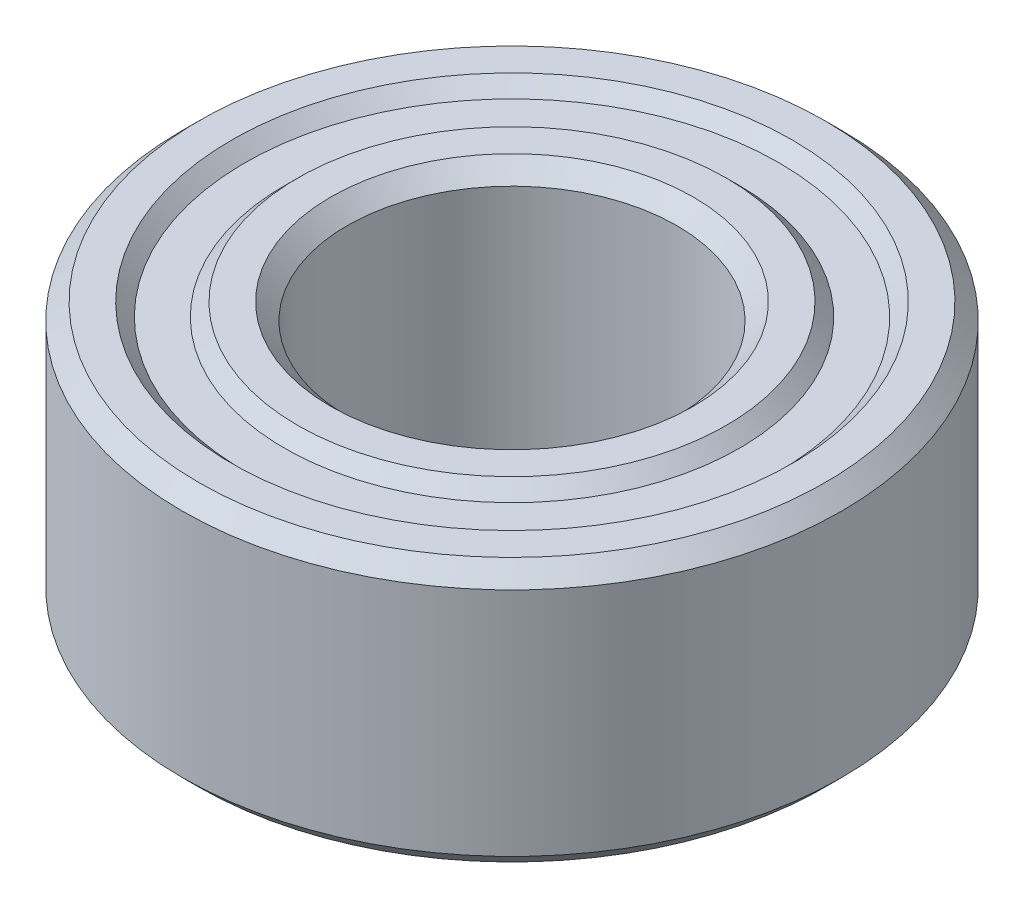
ISO-10303-21;
HEADER;
FILE_DESCRIPTION(('STEP AP214'),'2;1');
FILE_NAME('part.step','',(''),(''),'','','');
FILE_SCHEMA(('AUTOMOTIVE_DESIGN { 1 0 10303 214 1 1 1 1 }'));
ENDSEC;
DATA;
#1=APPLICATION_CONTEXT('core data for automotive mechanical design processes');
#2=APPLICATION_PROTOCOL_DEFINITION('international standard','automotive_design',2000,#1);
#3=PRODUCT_CONTEXT('',#1,'mechanical');
#4=PRODUCT('Part','Part','',(#3));
#5=PRODUCT_RELATED_PRODUCT_CATEGORY('part','',(#4));
#6=PRODUCT_DEFINITION_FORMATION('','',#4);
#7=PRODUCT_DEFINITION_CONTEXT('part definition',#1,'design');
#8=PRODUCT_DEFINITION('design','',#6,#7);
#9=PRODUCT_DEFINITION_SHAPE('','',#8);
#10=(LENGTH_UNIT() NAMED_UNIT(*) SI_UNIT(.MILLI.,.METRE.));
#11=(NAMED_UNIT(*) PLANE_ANGLE_UNIT() SI_UNIT($,.RADIAN.));
#12=(NAMED_UNIT(*) SI_UNIT($,.STERADIAN.) SOLID_ANGLE_UNIT());
#13=UNCERTAINTY_MEASURE_WITH_UNIT(LENGTH_MEASURE(1.E-05),#10,'distance_accuracy_value','');
#14=(GEOMETRIC_REPRESENTATION_CONTEXT(3) GLOBAL_UNCERTAINTY_ASSIGNED_CONTEXT((#13)) GLOBAL_UNIT_ASSIGNED_CONTEXT((#10,
#11,#12)) REPRESENTATION_CONTEXT('',''));
#15=CARTESIAN_POINT('',(0.,0.,0.));
#16=DIRECTION('',(0.,0.,1.));
#17=DIRECTION('',(1.,0.,0.));
#18=AXIS2_PLACEMENT_3D('',#15,#16,#17);
#19=CARTESIAN_POINT('',(0.,2.,0.));
#20=DIRECTION('',(0.,1.,0.));
#21=DIRECTION('',(0.,0.,1.));
#22=AXIS2_PLACEMENT_3D('',#19,#20,#21);
#23=CONICAL_SURFACE('',#22,2.75,0.785398163397447);
#24=CARTESIAN_POINT('',(0.,1.75,0.));
#25=DIRECTION('',(0.,-1.,0.));
#26=DIRECTION('',(0.,0.,-1.));
#27=AXIS2_PLACEMENT_3D('',#24,#25,#26);
#28=CIRCLE('',#27,2.5);
#29=CARTESIAN_POINT('',(0.,1.75,-2.5));
#30=VERTEX_POINT('',#29);
#31=EDGE_CURVE('E10',#30,#30,#28,.T.);
#32=ORIENTED_EDGE('',*,*,#31,.T.);
#33=EDGE_LOOP('',(#32));
#34=FACE_BOUND('',#33,.T.);
#35=CARTESIAN_POINT('',(0.,2.,0.));
#36=DIRECTION('',(0.,-1.,0.));
#37=DIRECTION('',(0.,0.,-1.));
#38=AXIS2_PLACEMENT_3D('',#35,#36,#37);
#39=CIRCLE('',#38,2.75);
#40=CARTESIAN_POINT('',(0.,2.,-2.75));
#41=VERTEX_POINT('',#40);
#42=EDGE_CURVE('E88',#41,#41,#39,.T.);
#43=ORIENTED_EDGE('',*,*,#42,.F.);
#44=EDGE_LOOP('',(#43));
#45=FACE_BOUND('',#44,.T.);
#46=ADVANCED_FACE('F36',(#34,#45),#23,.F.);
#47=CARTESIAN_POINT('',(0.,-1.34942197217015,0.));
#48=DIRECTION('',(0.,-1.,0.));
#49=DIRECTION('',(0.,0.,-1.));
#50=AXIS2_PLACEMENT_3D('',#47,#48,#49);
#51=CYLINDRICAL_SURFACE('',#50,2.5);
#52=CARTESIAN_POINT('',(0.,-1.75,0.));
#53=DIRECTION('',(0.,-1.,0.));
#54=DIRECTION('',(0.,0.,-1.));
#55=AXIS2_PLACEMENT_3D('',#52,#53,#54);
#56=CIRCLE('',#55,2.5);
#57=CARTESIAN_POINT('',(0.,-1.75,-2.5));
#58=VERTEX_POINT('',#57);
#59=EDGE_CURVE('E42',#58,#58,#56,.T.);
#60=ORIENTED_EDGE('',*,*,#59,.T.);
#61=EDGE_LOOP('',(#60));
#62=FACE_BOUND('',#61,.T.);
#63=ORIENTED_EDGE('',*,*,#31,.F.);
#64=EDGE_LOOP('',(#63));
#65=FACE_BOUND('',#64,.T.);
#66=ADVANCED_FACE('F96',(#62,#65),#51,.F.);
#67=CARTESIAN_POINT('',(0.,-1.75,0.));
#68=DIRECTION('',(0.,-1.,0.));
#69=DIRECTION('',(0.,0.,-1.));
#70=AXIS2_PLACEMENT_3D('',#67,#68,#69);
#71=CONICAL_SURFACE('',#70,2.5,0.785398163397447);
#72=CARTESIAN_POINT('',(0.,-2.,0.));
#73=DIRECTION('',(0.,-1.,0.));
#74=DIRECTION('',(0.,0.,-1.));
#75=AXIS2_PLACEMENT_3D('',#72,#73,#74);
#76=CIRCLE('',#75,2.75);
#77=CARTESIAN_POINT('',(0.,-2.,-2.75));
#78=VERTEX_POINT('',#77);
#79=EDGE_CURVE('E46',#78,#78,#76,.T.);
#80=ORIENTED_EDGE('',*,*,#79,.T.);
#81=EDGE_LOOP('',(#80));
#82=FACE_BOUND('',#81,.T.);
#83=ORIENTED_EDGE('',*,*,#59,.F.);
#84=EDGE_LOOP('',(#83));
#85=FACE_BOUND('',#84,.T.);
#86=ADVANCED_FACE('F100',(#82,#85),#71,.F.);
#87=CARTESIAN_POINT('',(2.75,-2.,0.));
#88=DIRECTION('',(0.,-1.,0.));
#89=DIRECTION('',(0.,0.,-1.));
#90=AXIS2_PLACEMENT_3D('',#87,#88,#89);
#91=PLANE('',#90);
#92=CARTESIAN_POINT('',(0.,-2.,0.));
#93=DIRECTION('',(0.,-1.,0.));
#94=DIRECTION('',(0.,0.,-1.));
#95=AXIS2_PLACEMENT_3D('',#92,#93,#94);
#96=CIRCLE('',#95,3.25);
#97=CARTESIAN_POINT('',(0.,-2.,-3.25));
#98=VERTEX_POINT('',#97);
#99=EDGE_CURVE('E50',#98,#98,#96,.T.);
#100=ORIENTED_EDGE('',*,*,#99,.T.);
#101=EDGE_LOOP('',(#100));
#102=FACE_BOUND('',#101,.T.);
#103=ORIENTED_EDGE('',*,*,#79,.F.);
#104=EDGE_LOOP('',(#103));
#105=FACE_BOUND('',#104,.T.);
#106=ADVANCED_FACE('F104',(#102,#105),#91,.T.);
#107=CARTESIAN_POINT('',(0.,-2.,0.));
#108=DIRECTION('',(0.,1.,0.));
#109=DIRECTION('',(0.,0.,1.));
#110=AXIS2_PLACEMENT_3D('',#107,#108,#109);
#111=CONICAL_SURFACE('',#110,3.25,0.78539816339745);
#112=CARTESIAN_POINT('',(0.,-1.8,0.));
#113=DIRECTION('',(0.,-1.,0.));
#114=DIRECTION('',(0.,0.,-1.));
#115=AXIS2_PLACEMENT_3D('',#112,#113,#114);
#116=CIRCLE('',#115,3.45);
#117=CARTESIAN_POINT('',(0.,-1.8,-3.45));
#118=VERTEX_POINT('',#117);
#119=EDGE_CURVE('E55',#118,#118,#116,.T.);
#120=ORIENTED_EDGE('',*,*,#119,.T.);
#121=EDGE_LOOP('',(#120));
#122=FACE_BOUND('',#121,.T.);
#123=ORIENTED_EDGE('',*,*,#99,.F.);
#124=EDGE_LOOP('',(#123));
#125=FACE_BOUND('',#124,.T.);
#126=ADVANCED_FACE('F111',(#122,#125),#111,.T.);
#127=CARTESIAN_POINT('',(3.45,-1.8,0.));
#128=DIRECTION('',(0.,-1.,0.));
#129=DIRECTION('',(0.,0.,-1.));
#130=AXIS2_PLACEMENT_3D('',#127,#128,#129);
#131=PLANE('',#130);
#132=CARTESIAN_POINT('',(0.,-1.8,0.));
#133=DIRECTION('',(0.,-1.,0.));
#134=DIRECTION('',(0.,0.,-1.));
#135=AXIS2_PLACEMENT_3D('',#132,#133,#134);
#136=CIRCLE('',#135,4.05);
#137=CARTESIAN_POINT('',(0.,-1.8,-4.05));
#138=VERTEX_POINT('',#137);
#139=EDGE_CURVE('E58',#138,#138,#136,.T.);
#140=ORIENTED_EDGE('',*,*,#139,.T.);
#141=EDGE_LOOP('',(#140));
#142=FACE_BOUND('',#141,.T.);
#143=ORIENTED_EDGE('',*,*,#119,.F.);
#144=EDGE_LOOP('',(#143));
#145=FACE_BOUND('',#144,.T.);
#146=ADVANCED_FACE('F115',(#142,#145),#131,.T.);
#147=CARTESIAN_POINT('',(0.,-1.8,0.));
#148=DIRECTION('',(0.,-1.,0.));
#149=DIRECTION('',(0.,0.,-1.));
#150=AXIS2_PLACEMENT_3D('',#147,#148,#149);
#151=CONICAL_SURFACE('',#150,4.05,0.78539816339745);
#152=CARTESIAN_POINT('',(0.,-2.,0.));
#153=DIRECTION('',(0.,-1.,0.));
#154=DIRECTION('',(0.,0.,-1.));
#155=AXIS2_PLACEMENT_3D('',#152,#153,#154);
#156=CIRCLE('',#155,4.25);
#157=CARTESIAN_POINT('',(0.,-2.,-4.25));
#158=VERTEX_POINT('',#157);
#159=EDGE_CURVE('E61',#158,#158,#156,.T.);
#160=ORIENTED_EDGE('',*,*,#159,.T.);
#161=EDGE_LOOP('',(#160));
#162=FACE_BOUND('',#161,.T.);
#163=ORIENTED_EDGE('',*,*,#139,.F.);
#164=EDGE_LOOP('',(#163));
#165=FACE_BOUND('',#164,.T.);
#166=ADVANCED_FACE('F119',(#162,#165),#151,.F.);
#167=CARTESIAN_POINT('',(4.25,-2.,0.));
#168=DIRECTION('',(0.,-1.,0.));
#169=DIRECTION('',(0.,0.,-1.));
#170=AXIS2_PLACEMENT_3D('',#167,#168,#169);
#171=PLANE('',#170);
#172=CARTESIAN_POINT('',(0.,-2.,0.));
#173=DIRECTION('',(0.,-1.,0.));
#174=DIRECTION('',(0.,0.,-1.));
#175=AXIS2_PLACEMENT_3D('',#172,#173,#174);
#176=CIRCLE('',#175,4.75);
#177=CARTESIAN_POINT('',(0.,-2.,-4.75));
#178=VERTEX_POINT('',#177);
#179=EDGE_CURVE('E64',#178,#178,#176,.T.);
#180=ORIENTED_EDGE('',*,*,#179,.T.);
#181=EDGE_LOOP('',(#180));
#182=FACE_BOUND('',#181,.T.);
#183=ORIENTED_EDGE('',*,*,#159,.F.);
#184=EDGE_LOOP('',(#183));
#185=FACE_BOUND('',#184,.T.);
#186=ADVANCED_FACE('F123',(#182,#185),#171,.T.);
#187=CARTESIAN_POINT('',(0.,-2.,0.));
#188=DIRECTION('',(0.,1.,0.));
#189=DIRECTION('',(0.,0.,1.));
#190=AXIS2_PLACEMENT_3D('',#187,#188,#189);
#191=CONICAL_SURFACE('',#190,4.75,0.785398163397449);
#192=CARTESIAN_POINT('',(0.,-1.75,0.));
#193=DIRECTION('',(0.,-1.,0.));
#194=DIRECTION('',(0.,0.,-1.));
#195=AXIS2_PLACEMENT_3D('',#192,#193,#194);
#196=CIRCLE('',#195,5.);
#197=CARTESIAN_POINT('',(0.,-1.75,-5.));
#198=VERTEX_POINT('',#197);
#199=EDGE_CURVE('E67',#198,#198,#196,.T.);
#200=ORIENTED_EDGE('',*,*,#199,.T.);
#201=EDGE_LOOP('',(#200));
#202=FACE_BOUND('',#201,.T.);
#203=ORIENTED_EDGE('',*,*,#179,.F.);
#204=EDGE_LOOP('',(#203));
#205=FACE_BOUND('',#204,.T.);
#206=ADVANCED_FACE('F127',(#202,#205),#191,.T.);
#207=CARTESIAN_POINT('',(0.,-1.34942197217015,0.));
#208=DIRECTION('',(0.,-1.,0.));
#209=DIRECTION('',(0.,0.,-1.));
#210=AXIS2_PLACEMENT_3D('',#207,#208,#209);
#211=CYLINDRICAL_SURFACE('',#210,5.);
#212=CARTESIAN_POINT('',(0.,1.75,0.));
#213=DIRECTION('',(0.,-1.,0.));
#214=DIRECTION('',(0.,0.,-1.));
#215=AXIS2_PLACEMENT_3D('',#212,#213,#214);
#216=CIRCLE('',#215,5.);
#217=CARTESIAN_POINT('',(0.,1.75,-5.));
#218=VERTEX_POINT('',#217);
#219=EDGE_CURVE('E70',#218,#218,#216,.T.);
#220=ORIENTED_EDGE('',*,*,#219,.T.);
#221=EDGE_LOOP('',(#220));
#222=FACE_BOUND('',#221,.T.);
#223=ORIENTED_EDGE('',*,*,#199,.F.);
#224=EDGE_LOOP('',(#223));
#225=FACE_BOUND('',#224,.T.);
#226=ADVANCED_FACE('F131',(#222,#225),#211,.T.);
#227=CARTESIAN_POINT('',(0.,1.75,0.));
#228=DIRECTION('',(0.,-1.,0.));
#229=DIRECTION('',(0.,0.,-1.));
#230=AXIS2_PLACEMENT_3D('',#227,#228,#229);
#231=CONICAL_SURFACE('',#230,5.,0.785398163397451);
#232=CARTESIAN_POINT('',(0.,2.,0.));
#233=DIRECTION('',(0.,-1.,0.));
#234=DIRECTION('',(0.,0.,-1.));
#235=AXIS2_PLACEMENT_3D('',#232,#233,#234);
#236=CIRCLE('',#235,4.75);
#237=CARTESIAN_POINT('',(0.,2.,-4.75));
#238=VERTEX_POINT('',#237);
#239=EDGE_CURVE('E73',#238,#238,#236,.T.);
#240=ORIENTED_EDGE('',*,*,#239,.T.);
#241=EDGE_LOOP('',(#240));
#242=FACE_BOUND('',#241,.T.);
#243=ORIENTED_EDGE('',*,*,#219,.F.);
#244=EDGE_LOOP('',(#243));
#245=FACE_BOUND('',#244,.T.);
#246=ADVANCED_FACE('F135',(#242,#245),#231,.T.);
#247=CARTESIAN_POINT('',(4.75,2.,0.));
#248=DIRECTION('',(0.,1.,0.));
#249=DIRECTION('',(0.,0.,1.));
#250=AXIS2_PLACEMENT_3D('',#247,#248,#249);
#251=PLANE('',#250);
#252=CARTESIAN_POINT('',(0.,2.,0.));
#253=DIRECTION('',(0.,-1.,0.));
#254=DIRECTION('',(0.,0.,-1.));
#255=AXIS2_PLACEMENT_3D('',#252,#253,#254);
#256=CIRCLE('',#255,4.25);
#257=CARTESIAN_POINT('',(0.,2.,-4.25));
#258=VERTEX_POINT('',#257);
#259=EDGE_CURVE('E76',#258,#258,#256,.T.);
#260=ORIENTED_EDGE('',*,*,#259,.T.);
#261=EDGE_LOOP('',(#260));
#262=FACE_BOUND('',#261,.T.);
#263=ORIENTED_EDGE('',*,*,#239,.F.);
#264=EDGE_LOOP('',(#263));
#265=FACE_BOUND('',#264,.T.);
#266=ADVANCED_FACE('F139',(#262,#265),#251,.T.);
#267=CARTESIAN_POINT('',(0.,2.,0.));
#268=DIRECTION('',(0.,1.,0.));
#269=DIRECTION('',(0.,0.,1.));
#270=AXIS2_PLACEMENT_3D('',#267,#268,#269);
#271=CONICAL_SURFACE('',#270,4.25,0.785398163397449);
#272=CARTESIAN_POINT('',(0.,1.8,0.));
#273=DIRECTION('',(0.,-1.,0.));
#274=DIRECTION('',(0.,0.,-1.));
#275=AXIS2_PLACEMENT_3D('',#272,#273,#274);
#276=CIRCLE('',#275,4.05);
#277=CARTESIAN_POINT('',(0.,1.8,-4.05));
#278=VERTEX_POINT('',#277);
#279=EDGE_CURVE('E79',#278,#278,#276,.T.);
#280=ORIENTED_EDGE('',*,*,#279,.T.);
#281=EDGE_LOOP('',(#280));
#282=FACE_BOUND('',#281,.T.);
#283=ORIENTED_EDGE('',*,*,#259,.F.);
#284=EDGE_LOOP('',(#283));
#285=FACE_BOUND('',#284,.T.);
#286=ADVANCED_FACE('F143',(#282,#285),#271,.F.);
#287=CARTESIAN_POINT('',(4.05,1.8,0.));
#288=DIRECTION('',(0.,1.,0.));
#289=DIRECTION('',(0.,0.,1.));
#290=AXIS2_PLACEMENT_3D('',#287,#288,#289);
#291=PLANE('',#290);
#292=CARTESIAN_POINT('',(0.,1.8,0.));
#293=DIRECTION('',(0.,-1.,0.));
#294=DIRECTION('',(0.,0.,-1.));
#295=AXIS2_PLACEMENT_3D('',#292,#293,#294);
#296=CIRCLE('',#295,3.45);
#297=CARTESIAN_POINT('',(0.,1.8,-3.45));
#298=VERTEX_POINT('',#297);
#299=EDGE_CURVE('E82',#298,#298,#296,.T.);
#300=ORIENTED_EDGE('',*,*,#299,.T.);
#301=EDGE_LOOP('',(#300));
#302=FACE_BOUND('',#301,.T.);
#303=ORIENTED_EDGE('',*,*,#279,.F.);
#304=EDGE_LOOP('',(#303));
#305=FACE_BOUND('',#304,.T.);
#306=ADVANCED_FACE('F147',(#302,#305),#291,.T.);
#307=CARTESIAN_POINT('',(0.,1.8,0.));
#308=DIRECTION('',(0.,-1.,0.));
#309=DIRECTION('',(0.,0.,-1.));
#310=AXIS2_PLACEMENT_3D('',#307,#308,#309);
#311=CONICAL_SURFACE('',#310,3.45,0.785398163397447);
#312=CARTESIAN_POINT('',(0.,2.,0.));
#313=DIRECTION('',(0.,-1.,0.));
#314=DIRECTION('',(0.,0.,-1.));
#315=AXIS2_PLACEMENT_3D('',#312,#313,#314);
#316=CIRCLE('',#315,3.25);
#317=CARTESIAN_POINT('',(0.,2.,-3.25));
#318=VERTEX_POINT('',#317);
#319=EDGE_CURVE('E85',#318,#318,#316,.T.);
#320=ORIENTED_EDGE('',*,*,#319,.T.);
#321=EDGE_LOOP('',(#320));
#322=FACE_BOUND('',#321,.T.);
#323=ORIENTED_EDGE('',*,*,#299,.F.);
#324=EDGE_LOOP('',(#323));
#325=FACE_BOUND('',#324,.T.);
#326=ADVANCED_FACE('F151',(#322,#325),#311,.T.);
#327=CARTESIAN_POINT('',(3.25,2.,0.));
#328=DIRECTION('',(0.,1.,0.));
#329=DIRECTION('',(0.,0.,1.));
#330=AXIS2_PLACEMENT_3D('',#327,#328,#329);
#331=PLANE('',#330);
#332=ORIENTED_EDGE('',*,*,#42,.T.);
#333=EDGE_LOOP('',(#332));
#334=FACE_BOUND('',#333,.T.);
#335=ORIENTED_EDGE('',*,*,#319,.F.);
#336=EDGE_LOOP('',(#335));
#337=FACE_BOUND('',#336,.T.);
#338=ADVANCED_FACE('F92',(#334,#337),#331,.T.);
#339=CLOSED_SHELL('',(#46,#66,#86,#106,#126,#146,#166,#186,#206,#226,#246,#266,#286,#306,#326,#338));
#340=MANIFOLD_SOLID_BREP('B2',#339);
#341=ADVANCED_BREP_SHAPE_REPRESENTATION('',(#18,#340),#14);
#342=SHAPE_DEFINITION_REPRESENTATION(#9,#341);
ENDSEC;
END-ISO-10303-21;
